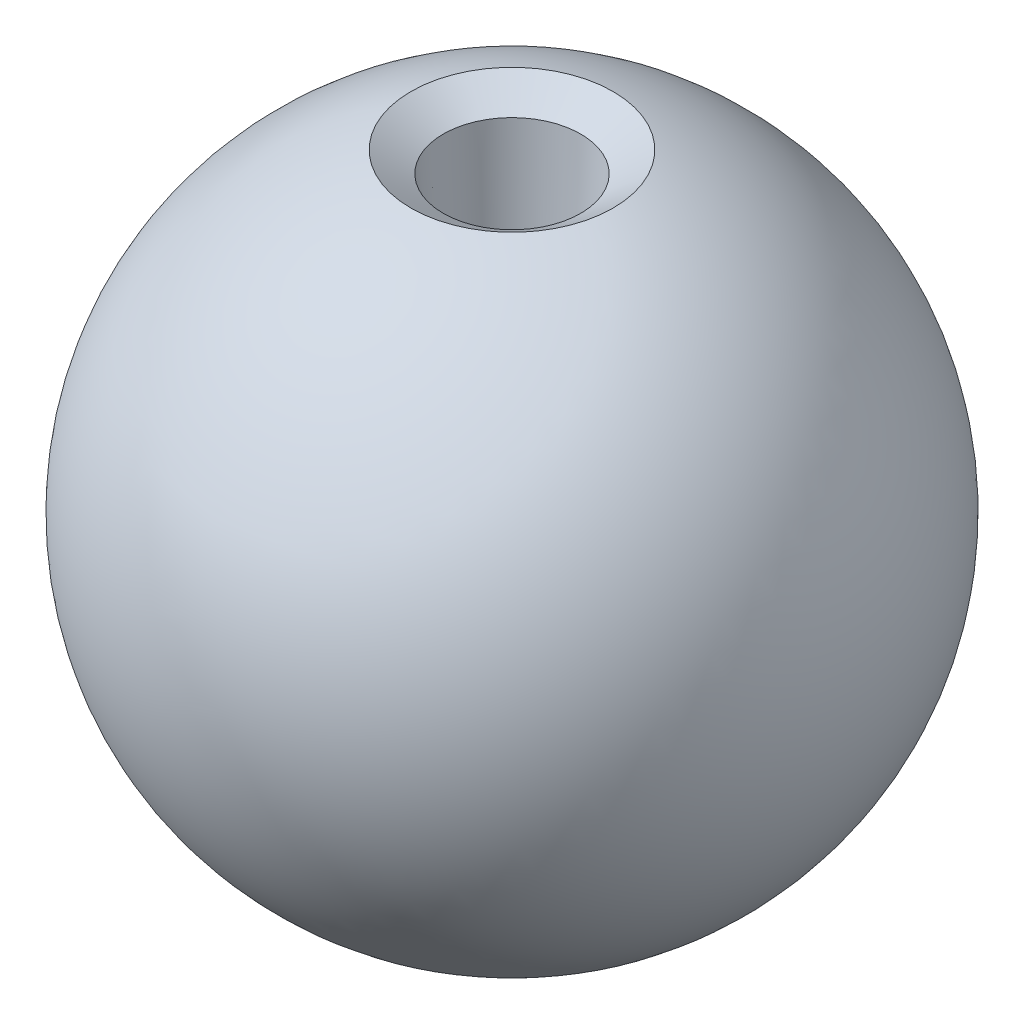
ISO-10303-21;
HEADER;
FILE_DESCRIPTION(('STEP AP214'),'2;1');
FILE_NAME('part.step','',(''),(''),'','','');
FILE_SCHEMA(('AUTOMOTIVE_DESIGN { 1 0 10303 214 1 1 1 1 }'));
ENDSEC;
DATA;
#1=APPLICATION_CONTEXT('core data for automotive mechanical design processes');
#2=APPLICATION_PROTOCOL_DEFINITION('international standard','automotive_design',2000,#1);
#3=PRODUCT_CONTEXT('',#1,'mechanical');
#4=PRODUCT('Part','Part','',(#3));
#5=PRODUCT_RELATED_PRODUCT_CATEGORY('part','',(#4));
#6=PRODUCT_DEFINITION_FORMATION('','',#4);
#7=PRODUCT_DEFINITION_CONTEXT('part definition',#1,'design');
#8=PRODUCT_DEFINITION('design','',#6,#7);
#9=PRODUCT_DEFINITION_SHAPE('','',#8);
#10=(LENGTH_UNIT() NAMED_UNIT(*) SI_UNIT(.MILLI.,.METRE.));
#11=(NAMED_UNIT(*) PLANE_ANGLE_UNIT() SI_UNIT($,.RADIAN.));
#12=(NAMED_UNIT(*) SI_UNIT($,.STERADIAN.) SOLID_ANGLE_UNIT());
#13=UNCERTAINTY_MEASURE_WITH_UNIT(LENGTH_MEASURE(1.E-05),#10,'distance_accuracy_value','');
#14=(GEOMETRIC_REPRESENTATION_CONTEXT(3) GLOBAL_UNCERTAINTY_ASSIGNED_CONTEXT((#13)) GLOBAL_UNIT_ASSIGNED_CONTEXT((#10,
#11,#12)) REPRESENTATION_CONTEXT('',''));
#15=CARTESIAN_POINT('',(0.,0.,0.));
#16=DIRECTION('',(0.,0.,1.));
#17=DIRECTION('',(1.,0.,0.));
#18=AXIS2_PLACEMENT_3D('',#15,#16,#17);
#19=CARTESIAN_POINT('',(0.,0.,0.));
#20=DIRECTION('',(0.,-1.,0.));
#21=DIRECTION('',(0.,0.,1.));
#22=AXIS2_PLACEMENT_3D('',#19,#20,#21);
#23=SPHERICAL_SURFACE('',#22,10.);
#24=CARTESIAN_POINT('',(0.,9.51869735919813,0.));
#25=DIRECTION('',(0.,-1.,0.));
#26=DIRECTION('',(0.,0.,-1.));
#27=AXIS2_PLACEMENT_3D('',#24,#25,#26);
#28=CIRCLE('',#27,3.0650286432584);
#29=CARTESIAN_POINT('',(0.,9.51869735919813,-3.0650286432584));
#30=VERTEX_POINT('',#29);
#31=EDGE_CURVE('E10',#30,#30,#28,.T.);
#32=ORIENTED_EDGE('',*,*,#31,.T.);
#33=EDGE_LOOP('',(#32));
#34=FACE_BOUND('',#33,.T.);
#35=ADVANCED_FACE('F31',(#34),#23,.T.);
#36=CARTESIAN_POINT('',(0.,0.,-1.5));
#37=DIRECTION('',(0.,-1.,0.));
#38=DIRECTION('',(0.,0.,-1.));
#39=AXIS2_PLACEMENT_3D('',#36,#37,#38);
#40=PLANE('',#39);
#41=CARTESIAN_POINT('',(0.,0.,0.));
#42=DIRECTION('',(0.,-1.,0.));
#43=DIRECTION('',(0.,0.,-1.));
#44=AXIS2_PLACEMENT_3D('',#41,#42,#43);
#45=CIRCLE('',#44,1.5);
#46=CARTESIAN_POINT('',(0.,0.,-1.5));
#47=VERTEX_POINT('',#46);
#48=EDGE_CURVE('E42',#47,#47,#45,.T.);
#49=ORIENTED_EDGE('',*,*,#48,.F.);
#50=EDGE_LOOP('',(#49));
#51=FACE_BOUND('',#50,.T.);
#52=ADVANCED_FACE('F51',(#51),#40,.F.);
#53=CARTESIAN_POINT('',(0.,0.,0.));
#54=DIRECTION('',(0.,1.,0.));
#55=DIRECTION('',(0.,0.,1.));
#56=AXIS2_PLACEMENT_3D('',#53,#54,#55);
#57=CONICAL_SURFACE('',#56,1.5,0.0656948015524648);
#58=CARTESIAN_POINT('',(0.,8.89124097934599,0.));
#59=DIRECTION('',(0.,1.,0.));
#60=DIRECTION('',(0.,0.,1.));
#61=AXIS2_PLACEMENT_3D('',#58,#59,#60);
#62=CIRCLE('',#61,2.08495006443066);
#63=CARTESIAN_POINT('',(0.,8.89124097934599,2.08495006443066));
#64=VERTEX_POINT('',#63);
#65=EDGE_CURVE('E38',#64,#64,#62,.T.);
#66=ORIENTED_EDGE('',*,*,#65,.T.);
#67=EDGE_LOOP('',(#66));
#68=FACE_BOUND('',#67,.T.);
#69=ORIENTED_EDGE('',*,*,#48,.T.);
#70=EDGE_LOOP('',(#69));
#71=FACE_BOUND('',#70,.T.);
#72=ADVANCED_FACE('F49',(#68,#71),#57,.F.);
#73=CARTESIAN_POINT('',(0.,8.89124097934599,0.));
#74=DIRECTION('',(0.,1.,0.));
#75=DIRECTION('',(0.,0.,1.));
#76=AXIS2_PLACEMENT_3D('',#73,#74,#75);
#77=CONICAL_SURFACE('',#76,2.08495006443066,1.00133397396578);
#78=ORIENTED_EDGE('',*,*,#31,.F.);
#79=EDGE_LOOP('',(#78));
#80=FACE_BOUND('',#79,.T.);
#81=ORIENTED_EDGE('',*,*,#65,.F.);
#82=EDGE_LOOP('',(#81));
#83=FACE_BOUND('',#82,.T.);
#84=ADVANCED_FACE('F33',(#80,#83),#77,.F.);
#85=CLOSED_SHELL('',(#35,#52,#72,#84));
#86=MANIFOLD_SOLID_BREP('B2',#85);
#87=ADVANCED_BREP_SHAPE_REPRESENTATION('',(#18,#86),#14);
#88=SHAPE_DEFINITION_REPRESENTATION(#9,#87);
ENDSEC;
END-ISO-10303-21;
